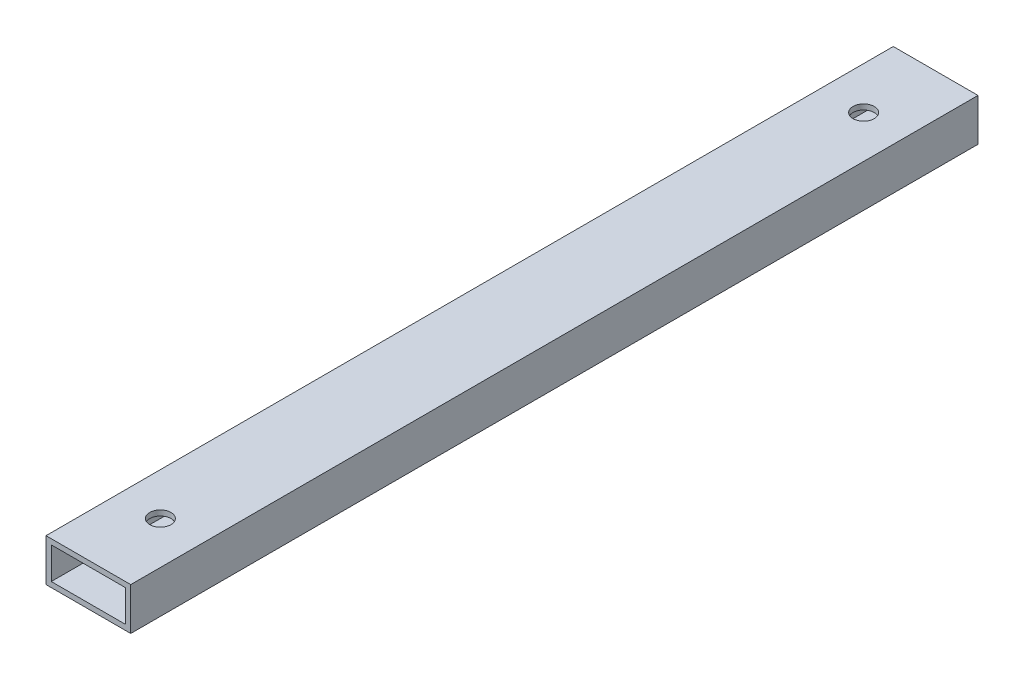
ISO-10303-21;
HEADER;
FILE_DESCRIPTION(('STEP AP214'),'2;1');
FILE_NAME('part.step','',(''),(''),'','','');
FILE_SCHEMA(('AUTOMOTIVE_DESIGN { 1 0 10303 214 1 1 1 1 }'));
ENDSEC;
DATA;
#1=APPLICATION_CONTEXT('core data for automotive mechanical design processes');
#2=APPLICATION_PROTOCOL_DEFINITION('international standard','automotive_design',2000,#1);
#3=PRODUCT_CONTEXT('',#1,'mechanical');
#4=PRODUCT('Part','Part','',(#3));
#5=PRODUCT_RELATED_PRODUCT_CATEGORY('part','',(#4));
#6=PRODUCT_DEFINITION_FORMATION('','',#4);
#7=PRODUCT_DEFINITION_CONTEXT('part definition',#1,'design');
#8=PRODUCT_DEFINITION('design','',#6,#7);
#9=PRODUCT_DEFINITION_SHAPE('','',#8);
#10=(LENGTH_UNIT() NAMED_UNIT(*) SI_UNIT(.MILLI.,.METRE.));
#11=(NAMED_UNIT(*) PLANE_ANGLE_UNIT() SI_UNIT($,.RADIAN.));
#12=(NAMED_UNIT(*) SI_UNIT($,.STERADIAN.) SOLID_ANGLE_UNIT());
#13=UNCERTAINTY_MEASURE_WITH_UNIT(LENGTH_MEASURE(1.E-05),#10,'distance_accuracy_value','');
#14=(GEOMETRIC_REPRESENTATION_CONTEXT(3) GLOBAL_UNCERTAINTY_ASSIGNED_CONTEXT((#13)) GLOBAL_UNIT_ASSIGNED_CONTEXT((#10,
#11,#12)) REPRESENTATION_CONTEXT('',''));
#15=CARTESIAN_POINT('',(0.,0.,0.));
#16=DIRECTION('',(0.,0.,1.));
#17=DIRECTION('',(1.,0.,0.));
#18=AXIS2_PLACEMENT_3D('',#15,#16,#17);
#19=CARTESIAN_POINT('',(0.,0.,508.));
#20=DIRECTION('',(0.,0.,1.));
#21=DIRECTION('',(1.,0.,0.));
#22=AXIS2_PLACEMENT_3D('',#19,#20,#21);
#23=PLANE('',#22);
#24=DIRECTION('',(0.,1.,0.));
#25=VECTOR('',#24,1.);
#26=CARTESIAN_POINT('',(25.4,-12.7,508.));
#27=LINE('',#26,#25);
#28=CARTESIAN_POINT('',(25.4,-12.7,508.));
#29=VERTEX_POINT('',#28);
#30=CARTESIAN_POINT('',(25.4,12.7,508.));
#31=VERTEX_POINT('',#30);
#32=EDGE_CURVE('E161',#29,#31,#27,.T.);
#33=ORIENTED_EDGE('',*,*,#32,.T.);
#34=DIRECTION('',(-1.,0.,0.));
#35=VECTOR('',#34,1.);
#36=CARTESIAN_POINT('',(-25.4,12.7,508.));
#37=LINE('',#36,#35);
#38=CARTESIAN_POINT('',(-25.4,12.7,508.));
#39=VERTEX_POINT('',#38);
#40=EDGE_CURVE('E164',#31,#39,#37,.T.);
#41=ORIENTED_EDGE('',*,*,#40,.T.);
#42=DIRECTION('',(0.,-1.,0.));
#43=VECTOR('',#42,1.);
#44=CARTESIAN_POINT('',(-25.4,-12.7,508.));
#45=LINE('',#44,#43);
#46=CARTESIAN_POINT('',(-25.4,-12.7,508.));
#47=VERTEX_POINT('',#46);
#48=EDGE_CURVE('E167',#39,#47,#45,.T.);
#49=ORIENTED_EDGE('',*,*,#48,.T.);
#50=DIRECTION('',(1.,0.,0.));
#51=VECTOR('',#50,1.);
#52=CARTESIAN_POINT('',(-25.4,-12.7,508.));
#53=LINE('',#52,#51);
#54=EDGE_CURVE('E169',#47,#29,#53,.T.);
#55=ORIENTED_EDGE('',*,*,#54,.T.);
#56=EDGE_LOOP('',(#33,#41,#49,#55));
#57=FACE_BOUND('',#56,.T.);
#58=DIRECTION('',(-1.,0.,0.));
#59=VECTOR('',#58,1.);
#60=CARTESIAN_POINT('',(0.,9.525,508.));
#61=LINE('',#60,#59);
#62=CARTESIAN_POINT('',(22.225,9.525,508.));
#63=VERTEX_POINT('',#62);
#64=CARTESIAN_POINT('',(-22.225,9.525,508.));
#65=VERTEX_POINT('',#64);
#66=EDGE_CURVE('E131',#63,#65,#61,.T.);
#67=ORIENTED_EDGE('',*,*,#66,.F.);
#68=DIRECTION('',(0.,1.,0.));
#69=VECTOR('',#68,1.);
#70=CARTESIAN_POINT('',(22.225,0.,508.));
#71=LINE('',#70,#69);
#72=CARTESIAN_POINT('',(22.225,-9.525,508.));
#73=VERTEX_POINT('',#72);
#74=EDGE_CURVE('E123',#73,#63,#71,.T.);
#75=ORIENTED_EDGE('',*,*,#74,.F.);
#76=DIRECTION('',(1.,0.,0.));
#77=VECTOR('',#76,1.);
#78=CARTESIAN_POINT('',(0.,-9.525,508.));
#79=LINE('',#78,#77);
#80=CARTESIAN_POINT('',(-22.225,-9.525,508.));
#81=VERTEX_POINT('',#80);
#82=EDGE_CURVE('E145',#81,#73,#79,.T.);
#83=ORIENTED_EDGE('',*,*,#82,.F.);
#84=DIRECTION('',(0.,-1.,0.));
#85=VECTOR('',#84,1.);
#86=CARTESIAN_POINT('',(-22.225,0.,508.));
#87=LINE('',#86,#85);
#88=EDGE_CURVE('E143',#65,#81,#87,.T.);
#89=ORIENTED_EDGE('',*,*,#88,.F.);
#90=EDGE_LOOP('',(#67,#75,#83,#89));
#91=FACE_BOUND('',#90,.T.);
#92=ADVANCED_FACE('F56',(#57,#91),#23,.T.);
#93=CARTESIAN_POINT('',(0.,0.,0.));
#94=DIRECTION('',(0.,0.,1.));
#95=DIRECTION('',(1.,0.,0.));
#96=AXIS2_PLACEMENT_3D('',#93,#94,#95);
#97=PLANE('',#96);
#98=DIRECTION('',(0.,1.,0.));
#99=VECTOR('',#98,1.);
#100=CARTESIAN_POINT('',(25.4,-12.7,0.));
#101=LINE('',#100,#99);
#102=CARTESIAN_POINT('',(25.4,-12.7,0.));
#103=VERTEX_POINT('',#102);
#104=CARTESIAN_POINT('',(25.4,12.7,0.));
#105=VERTEX_POINT('',#104);
#106=EDGE_CURVE('E139',#103,#105,#101,.T.);
#107=ORIENTED_EDGE('',*,*,#106,.F.);
#108=DIRECTION('',(1.,0.,0.));
#109=VECTOR('',#108,1.);
#110=CARTESIAN_POINT('',(-25.4,-12.7,0.));
#111=LINE('',#110,#109);
#112=CARTESIAN_POINT('',(-25.4,-12.7,0.));
#113=VERTEX_POINT('',#112);
#114=EDGE_CURVE('E165',#113,#103,#111,.T.);
#115=ORIENTED_EDGE('',*,*,#114,.F.);
#116=DIRECTION('',(0.,-1.,0.));
#117=VECTOR('',#116,1.);
#118=CARTESIAN_POINT('',(-25.4,-12.7,0.));
#119=LINE('',#118,#117);
#120=CARTESIAN_POINT('',(-25.4,12.7,0.));
#121=VERTEX_POINT('',#120);
#122=EDGE_CURVE('E176',#121,#113,#119,.T.);
#123=ORIENTED_EDGE('',*,*,#122,.F.);
#124=DIRECTION('',(-1.,0.,0.));
#125=VECTOR('',#124,1.);
#126=CARTESIAN_POINT('',(-25.4,12.7,0.));
#127=LINE('',#126,#125);
#128=EDGE_CURVE('E174',#105,#121,#127,.T.);
#129=ORIENTED_EDGE('',*,*,#128,.F.);
#130=EDGE_LOOP('',(#107,#115,#123,#129));
#131=FACE_BOUND('',#130,.T.);
#132=DIRECTION('',(0.,1.,0.));
#133=VECTOR('',#132,1.);
#134=CARTESIAN_POINT('',(22.225,0.,0.));
#135=LINE('',#134,#133);
#136=CARTESIAN_POINT('',(22.225,-9.525,0.));
#137=VERTEX_POINT('',#136);
#138=CARTESIAN_POINT('',(22.225,9.525,0.));
#139=VERTEX_POINT('',#138);
#140=EDGE_CURVE('E81',#137,#139,#135,.T.);
#141=ORIENTED_EDGE('',*,*,#140,.T.);
#142=DIRECTION('',(-1.,0.,0.));
#143=VECTOR('',#142,1.);
#144=CARTESIAN_POINT('',(0.,9.525,0.));
#145=LINE('',#144,#143);
#146=CARTESIAN_POINT('',(-22.225,9.525,0.));
#147=VERTEX_POINT('',#146);
#148=EDGE_CURVE('E138',#139,#147,#145,.T.);
#149=ORIENTED_EDGE('',*,*,#148,.T.);
#150=DIRECTION('',(0.,-1.,0.));
#151=VECTOR('',#150,1.);
#152=CARTESIAN_POINT('',(-22.225,0.,0.));
#153=LINE('',#152,#151);
#154=CARTESIAN_POINT('',(-22.225,-9.525,0.));
#155=VERTEX_POINT('',#154);
#156=EDGE_CURVE('E153',#147,#155,#153,.T.);
#157=ORIENTED_EDGE('',*,*,#156,.T.);
#158=DIRECTION('',(1.,0.,0.));
#159=VECTOR('',#158,1.);
#160=CARTESIAN_POINT('',(0.,-9.525,0.));
#161=LINE('',#160,#159);
#162=EDGE_CURVE('E132',#155,#137,#161,.T.);
#163=ORIENTED_EDGE('',*,*,#162,.T.);
#164=EDGE_LOOP('',(#141,#149,#157,#163));
#165=FACE_BOUND('',#164,.T.);
#166=ADVANCED_FACE('F223',(#131,#165),#97,.F.);
#167=CARTESIAN_POINT('',(25.4,-12.7,508.));
#168=DIRECTION('',(-1.,0.,0.));
#169=DIRECTION('',(0.,0.,1.));
#170=AXIS2_PLACEMENT_3D('',#167,#168,#169);
#171=PLANE('',#170);
#172=ORIENTED_EDGE('',*,*,#106,.T.);
#173=DIRECTION('',(0.,0.,-1.));
#174=VECTOR('',#173,1.);
#175=CARTESIAN_POINT('',(25.4,12.7,508.));
#176=LINE('',#175,#174);
#177=EDGE_CURVE('E12',#31,#105,#176,.T.);
#178=ORIENTED_EDGE('',*,*,#177,.F.);
#179=ORIENTED_EDGE('',*,*,#32,.F.);
#180=DIRECTION('',(0.,0.,-1.));
#181=VECTOR('',#180,1.);
#182=CARTESIAN_POINT('',(25.4,-12.7,508.));
#183=LINE('',#182,#181);
#184=EDGE_CURVE('E171',#29,#103,#183,.T.);
#185=ORIENTED_EDGE('',*,*,#184,.T.);
#186=EDGE_LOOP('',(#172,#178,#179,#185));
#187=FACE_BOUND('',#186,.T.);
#188=ADVANCED_FACE('F58',(#187),#171,.F.);
#189=CARTESIAN_POINT('',(-25.4,12.7,508.));
#190=DIRECTION('',(0.,-1.,0.));
#191=DIRECTION('',(0.,0.,-1.));
#192=AXIS2_PLACEMENT_3D('',#189,#190,#191);
#193=PLANE('',#192);
#194=CARTESIAN_POINT('',(0.,12.7,464.82));
#195=DIRECTION('',(0.,1.,0.));
#196=DIRECTION('',(0.,0.,1.));
#197=AXIS2_PLACEMENT_3D('',#194,#195,#196);
#198=CIRCLE('',#197,6.35);
#199=CARTESIAN_POINT('',(0.,12.7,471.17));
#200=VERTEX_POINT('',#199);
#201=EDGE_CURVE('E194',#200,#200,#198,.T.);
#202=ORIENTED_EDGE('',*,*,#201,.F.);
#203=EDGE_LOOP('',(#202));
#204=FACE_BOUND('',#203,.T.);
#205=CARTESIAN_POINT('',(0.,12.7,43.18));
#206=DIRECTION('',(0.,1.,0.));
#207=DIRECTION('',(0.,0.,1.));
#208=AXIS2_PLACEMENT_3D('',#205,#206,#207);
#209=CIRCLE('',#208,6.35);
#210=CARTESIAN_POINT('',(0.,12.7,49.53));
#211=VERTEX_POINT('',#210);
#212=EDGE_CURVE('E204',#211,#211,#209,.T.);
#213=ORIENTED_EDGE('',*,*,#212,.F.);
#214=EDGE_LOOP('',(#213));
#215=FACE_BOUND('',#214,.T.);
#216=ORIENTED_EDGE('',*,*,#128,.T.);
#217=DIRECTION('',(0.,0.,-1.));
#218=VECTOR('',#217,1.);
#219=CARTESIAN_POINT('',(-25.4,12.7,508.));
#220=LINE('',#219,#218);
#221=EDGE_CURVE('E65',#39,#121,#220,.T.);
#222=ORIENTED_EDGE('',*,*,#221,.F.);
#223=ORIENTED_EDGE('',*,*,#40,.F.);
#224=ORIENTED_EDGE('',*,*,#177,.T.);
#225=EDGE_LOOP('',(#216,#222,#223,#224));
#226=FACE_BOUND('',#225,.T.);
#227=ADVANCED_FACE('F247',(#204,#215,#226),#193,.F.);
#228=CARTESIAN_POINT('',(-25.4,-12.7,508.));
#229=DIRECTION('',(1.,0.,0.));
#230=DIRECTION('',(0.,0.,-1.));
#231=AXIS2_PLACEMENT_3D('',#228,#229,#230);
#232=PLANE('',#231);
#233=ORIENTED_EDGE('',*,*,#122,.T.);
#234=DIRECTION('',(0.,0.,-1.));
#235=VECTOR('',#234,1.);
#236=CARTESIAN_POINT('',(-25.4,-12.7,508.));
#237=LINE('',#236,#235);
#238=EDGE_CURVE('E181',#47,#113,#237,.T.);
#239=ORIENTED_EDGE('',*,*,#238,.F.);
#240=ORIENTED_EDGE('',*,*,#48,.F.);
#241=ORIENTED_EDGE('',*,*,#221,.T.);
#242=EDGE_LOOP('',(#233,#239,#240,#241));
#243=FACE_BOUND('',#242,.T.);
#244=ADVANCED_FACE('F245',(#243),#232,.F.);
#245=CARTESIAN_POINT('',(-25.4,-12.7,508.));
#246=DIRECTION('',(0.,1.,0.));
#247=DIRECTION('',(0.,0.,1.));
#248=AXIS2_PLACEMENT_3D('',#245,#246,#247);
#249=PLANE('',#248);
#250=CARTESIAN_POINT('',(0.,-12.7,464.82));
#251=DIRECTION('',(0.,1.,0.));
#252=DIRECTION('',(0.,0.,1.));
#253=AXIS2_PLACEMENT_3D('',#250,#251,#252);
#254=CIRCLE('',#253,6.35);
#255=CARTESIAN_POINT('',(0.,-12.7,471.17));
#256=VERTEX_POINT('',#255);
#257=EDGE_CURVE('E188',#256,#256,#254,.T.);
#258=ORIENTED_EDGE('',*,*,#257,.T.);
#259=EDGE_LOOP('',(#258));
#260=FACE_BOUND('',#259,.T.);
#261=CARTESIAN_POINT('',(0.,-12.7,43.18));
#262=DIRECTION('',(0.,1.,0.));
#263=DIRECTION('',(0.,0.,1.));
#264=AXIS2_PLACEMENT_3D('',#261,#262,#263);
#265=CIRCLE('',#264,6.35);
#266=CARTESIAN_POINT('',(0.,-12.7,49.53));
#267=VERTEX_POINT('',#266);
#268=EDGE_CURVE('E199',#267,#267,#265,.T.);
#269=ORIENTED_EDGE('',*,*,#268,.T.);
#270=EDGE_LOOP('',(#269));
#271=FACE_BOUND('',#270,.T.);
#272=ORIENTED_EDGE('',*,*,#114,.T.);
#273=ORIENTED_EDGE('',*,*,#184,.F.);
#274=ORIENTED_EDGE('',*,*,#54,.F.);
#275=ORIENTED_EDGE('',*,*,#238,.T.);
#276=EDGE_LOOP('',(#272,#273,#274,#275));
#277=FACE_BOUND('',#276,.T.);
#278=ADVANCED_FACE('F242',(#260,#271,#277),#249,.F.);
#279=CARTESIAN_POINT('',(22.225,0.,508.));
#280=DIRECTION('',(-1.,0.,0.));
#281=DIRECTION('',(0.,0.,1.));
#282=AXIS2_PLACEMENT_3D('',#279,#280,#281);
#283=PLANE('',#282);
#284=ORIENTED_EDGE('',*,*,#140,.F.);
#285=DIRECTION('',(0.,0.,-1.));
#286=VECTOR('',#285,1.);
#287=CARTESIAN_POINT('',(22.225,-9.525,508.));
#288=LINE('',#287,#286);
#289=EDGE_CURVE('E127',#73,#137,#288,.T.);
#290=ORIENTED_EDGE('',*,*,#289,.F.);
#291=ORIENTED_EDGE('',*,*,#74,.T.);
#292=DIRECTION('',(0.,0.,-1.));
#293=VECTOR('',#292,1.);
#294=CARTESIAN_POINT('',(22.225,9.525,508.));
#295=LINE('',#294,#293);
#296=EDGE_CURVE('E126',#63,#139,#295,.T.);
#297=ORIENTED_EDGE('',*,*,#296,.T.);
#298=EDGE_LOOP('',(#284,#290,#291,#297));
#299=FACE_BOUND('',#298,.T.);
#300=ADVANCED_FACE('F125',(#299),#283,.T.);
#301=CARTESIAN_POINT('',(0.,9.525,508.));
#302=DIRECTION('',(0.,-1.,0.));
#303=DIRECTION('',(0.,0.,-1.));
#304=AXIS2_PLACEMENT_3D('',#301,#302,#303);
#305=PLANE('',#304);
#306=CARTESIAN_POINT('',(0.,9.525,464.82));
#307=DIRECTION('',(0.,-1.,0.));
#308=DIRECTION('',(0.,0.,-1.));
#309=AXIS2_PLACEMENT_3D('',#306,#307,#308);
#310=CIRCLE('',#309,6.35);
#311=CARTESIAN_POINT('',(0.,9.525,458.47));
#312=VERTEX_POINT('',#311);
#313=EDGE_CURVE('E151',#312,#312,#310,.T.);
#314=ORIENTED_EDGE('',*,*,#313,.F.);
#315=EDGE_LOOP('',(#314));
#316=FACE_BOUND('',#315,.T.);
#317=CARTESIAN_POINT('',(0.,9.525,43.18));
#318=DIRECTION('',(0.,-1.,0.));
#319=DIRECTION('',(0.,0.,-1.));
#320=AXIS2_PLACEMENT_3D('',#317,#318,#319);
#321=CIRCLE('',#320,6.35);
#322=CARTESIAN_POINT('',(0.,9.525,36.83));
#323=VERTEX_POINT('',#322);
#324=EDGE_CURVE('E187',#323,#323,#321,.T.);
#325=ORIENTED_EDGE('',*,*,#324,.F.);
#326=EDGE_LOOP('',(#325));
#327=FACE_BOUND('',#326,.T.);
#328=ORIENTED_EDGE('',*,*,#148,.F.);
#329=ORIENTED_EDGE('',*,*,#296,.F.);
#330=ORIENTED_EDGE('',*,*,#66,.T.);
#331=DIRECTION('',(0.,0.,-1.));
#332=VECTOR('',#331,1.);
#333=CARTESIAN_POINT('',(-22.225,9.525,508.));
#334=LINE('',#333,#332);
#335=EDGE_CURVE('E140',#65,#147,#334,.T.);
#336=ORIENTED_EDGE('',*,*,#335,.T.);
#337=EDGE_LOOP('',(#328,#329,#330,#336));
#338=FACE_BOUND('',#337,.T.);
#339=ADVANCED_FACE('F135',(#316,#327,#338),#305,.T.);
#340=CARTESIAN_POINT('',(-22.225,0.,508.));
#341=DIRECTION('',(1.,0.,0.));
#342=DIRECTION('',(0.,0.,-1.));
#343=AXIS2_PLACEMENT_3D('',#340,#341,#342);
#344=PLANE('',#343);
#345=ORIENTED_EDGE('',*,*,#156,.F.);
#346=ORIENTED_EDGE('',*,*,#335,.F.);
#347=ORIENTED_EDGE('',*,*,#88,.T.);
#348=DIRECTION('',(0.,0.,-1.));
#349=VECTOR('',#348,1.);
#350=CARTESIAN_POINT('',(-22.225,-9.525,508.));
#351=LINE('',#350,#349);
#352=EDGE_CURVE('E73',#81,#155,#351,.T.);
#353=ORIENTED_EDGE('',*,*,#352,.T.);
#354=EDGE_LOOP('',(#345,#346,#347,#353));
#355=FACE_BOUND('',#354,.T.);
#356=ADVANCED_FACE('F219',(#355),#344,.T.);
#357=CARTESIAN_POINT('',(0.,-9.525,508.));
#358=DIRECTION('',(0.,1.,0.));
#359=DIRECTION('',(0.,0.,1.));
#360=AXIS2_PLACEMENT_3D('',#357,#358,#359);
#361=PLANE('',#360);
#362=CARTESIAN_POINT('',(0.,-9.525,464.82));
#363=DIRECTION('',(0.,1.,0.));
#364=DIRECTION('',(0.,0.,1.));
#365=AXIS2_PLACEMENT_3D('',#362,#363,#364);
#366=CIRCLE('',#365,6.35);
#367=CARTESIAN_POINT('',(0.,-9.525,471.17));
#368=VERTEX_POINT('',#367);
#369=EDGE_CURVE('E60',#368,#368,#366,.T.);
#370=ORIENTED_EDGE('',*,*,#369,.F.);
#371=EDGE_LOOP('',(#370));
#372=FACE_BOUND('',#371,.T.);
#373=CARTESIAN_POINT('',(0.,-9.525,43.18));
#374=DIRECTION('',(0.,1.,0.));
#375=DIRECTION('',(0.,0.,1.));
#376=AXIS2_PLACEMENT_3D('',#373,#374,#375);
#377=CIRCLE('',#376,6.35);
#378=CARTESIAN_POINT('',(0.,-9.525,49.53));
#379=VERTEX_POINT('',#378);
#380=EDGE_CURVE('E185',#379,#379,#377,.T.);
#381=ORIENTED_EDGE('',*,*,#380,.F.);
#382=EDGE_LOOP('',(#381));
#383=FACE_BOUND('',#382,.T.);
#384=ORIENTED_EDGE('',*,*,#162,.F.);
#385=ORIENTED_EDGE('',*,*,#352,.F.);
#386=ORIENTED_EDGE('',*,*,#82,.T.);
#387=ORIENTED_EDGE('',*,*,#289,.T.);
#388=EDGE_LOOP('',(#384,#385,#386,#387));
#389=FACE_BOUND('',#388,.T.);
#390=ADVANCED_FACE('F215',(#372,#383,#389),#361,.T.);
#391=CARTESIAN_POINT('',(0.,-12.7,43.18));
#392=DIRECTION('',(0.,1.,0.));
#393=DIRECTION('',(0.,0.,1.));
#394=AXIS2_PLACEMENT_3D('',#391,#392,#393);
#395=CYLINDRICAL_SURFACE('',#394,6.35);
#396=ORIENTED_EDGE('',*,*,#380,.T.);
#397=EDGE_LOOP('',(#396));
#398=FACE_BOUND('',#397,.T.);
#399=ORIENTED_EDGE('',*,*,#268,.F.);
#400=EDGE_LOOP('',(#399));
#401=FACE_BOUND('',#400,.T.);
#402=ADVANCED_FACE('F218',(#398,#401),#395,.F.);
#403=CARTESIAN_POINT('',(0.,-12.7,464.82));
#404=DIRECTION('',(0.,1.,0.));
#405=DIRECTION('',(0.,0.,1.));
#406=AXIS2_PLACEMENT_3D('',#403,#404,#405);
#407=CYLINDRICAL_SURFACE('',#406,6.35);
#408=ORIENTED_EDGE('',*,*,#369,.T.);
#409=EDGE_LOOP('',(#408));
#410=FACE_BOUND('',#409,.T.);
#411=ORIENTED_EDGE('',*,*,#257,.F.);
#412=EDGE_LOOP('',(#411));
#413=FACE_BOUND('',#412,.T.);
#414=ADVANCED_FACE('F212',(#410,#413),#407,.F.);
#415=ORIENTED_EDGE('',*,*,#324,.T.);
#416=EDGE_LOOP('',(#415));
#417=FACE_BOUND('',#416,.T.);
#418=ORIENTED_EDGE('',*,*,#212,.T.);
#419=EDGE_LOOP('',(#418));
#420=FACE_BOUND('',#419,.T.);
#421=ADVANCED_FACE('F271',(#417,#420),#395,.F.);
#422=ORIENTED_EDGE('',*,*,#313,.T.);
#423=EDGE_LOOP('',(#422));
#424=FACE_BOUND('',#423,.T.);
#425=ORIENTED_EDGE('',*,*,#201,.T.);
#426=EDGE_LOOP('',(#425));
#427=FACE_BOUND('',#426,.T.);
#428=ADVANCED_FACE('F273',(#424,#427),#407,.F.);
#429=CLOSED_SHELL('',(#92,#166,#188,#227,#244,#278,#300,#339,#356,#390,#402,#414,#421,#428));
#430=MANIFOLD_SOLID_BREP('B2',#429);
#431=ADVANCED_BREP_SHAPE_REPRESENTATION('',(#18,#430),#14);
#432=SHAPE_DEFINITION_REPRESENTATION(#9,#431);
ENDSEC;
END-ISO-10303-21;
